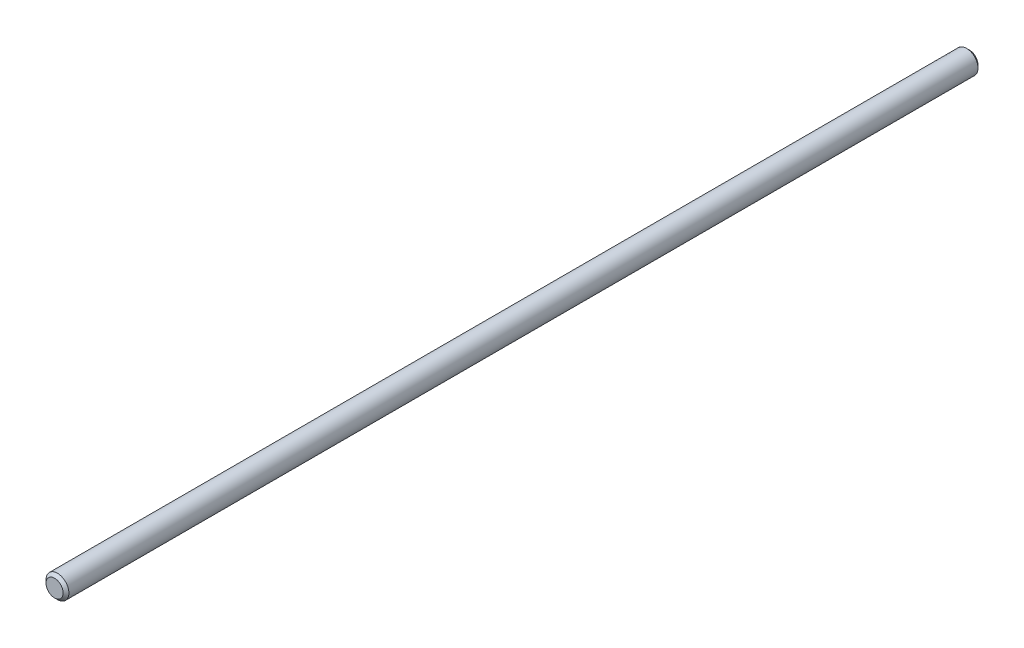
ISO-10303-21;
HEADER;
FILE_DESCRIPTION(('STEP AP214'),'2;1');
FILE_NAME('part.step','',(''),(''),'','','');
FILE_SCHEMA(('AUTOMOTIVE_DESIGN { 1 0 10303 214 1 1 1 1 }'));
ENDSEC;
DATA;
#1=APPLICATION_CONTEXT('core data for automotive mechanical design processes');
#2=APPLICATION_PROTOCOL_DEFINITION('international standard','automotive_design',2000,#1);
#3=PRODUCT_CONTEXT('',#1,'mechanical');
#4=PRODUCT('Part','Part','',(#3));
#5=PRODUCT_RELATED_PRODUCT_CATEGORY('part','',(#4));
#6=PRODUCT_DEFINITION_FORMATION('','',#4);
#7=PRODUCT_DEFINITION_CONTEXT('part definition',#1,'design');
#8=PRODUCT_DEFINITION('design','',#6,#7);
#9=PRODUCT_DEFINITION_SHAPE('','',#8);
#10=(LENGTH_UNIT() NAMED_UNIT(*) SI_UNIT(.MILLI.,.METRE.));
#11=(NAMED_UNIT(*) PLANE_ANGLE_UNIT() SI_UNIT($,.RADIAN.));
#12=(NAMED_UNIT(*) SI_UNIT($,.STERADIAN.) SOLID_ANGLE_UNIT());
#13=UNCERTAINTY_MEASURE_WITH_UNIT(LENGTH_MEASURE(1.E-05),#10,'distance_accuracy_value','');
#14=(GEOMETRIC_REPRESENTATION_CONTEXT(3) GLOBAL_UNCERTAINTY_ASSIGNED_CONTEXT((#13)) GLOBAL_UNIT_ASSIGNED_CONTEXT((#10,
#11,#12)) REPRESENTATION_CONTEXT('',''));
#15=CARTESIAN_POINT('',(0.,0.,0.));
#16=DIRECTION('',(0.,0.,1.));
#17=DIRECTION('',(1.,0.,0.));
#18=AXIS2_PLACEMENT_3D('',#15,#16,#17);
#19=CARTESIAN_POINT('',(0.,0.,80.));
#20=DIRECTION('',(0.,0.,-1.));
#21=DIRECTION('',(-1.,0.,0.));
#22=AXIS2_PLACEMENT_3D('',#19,#20,#21);
#23=CYLINDRICAL_SURFACE('',#22,2.);
#24=CARTESIAN_POINT('',(0.,0.,79.5));
#25=DIRECTION('',(0.,0.,1.));
#26=DIRECTION('',(1.,0.,0.));
#27=AXIS2_PLACEMENT_3D('',#24,#25,#26);
#28=CIRCLE('',#27,2.);
#29=CARTESIAN_POINT('',(2.,0.,79.5));
#30=VERTEX_POINT('',#29);
#31=EDGE_CURVE('E57',#30,#30,#28,.F.);
#32=ORIENTED_EDGE('',*,*,#31,.T.);
#33=EDGE_LOOP('',(#32));
#34=FACE_BOUND('',#33,.T.);
#35=CARTESIAN_POINT('',(0.,0.,-79.5));
#36=DIRECTION('',(0.,0.,1.));
#37=DIRECTION('',(1.,0.,0.));
#38=AXIS2_PLACEMENT_3D('',#35,#36,#37);
#39=CIRCLE('',#38,2.);
#40=CARTESIAN_POINT('',(2.,0.,-79.5));
#41=VERTEX_POINT('',#40);
#42=EDGE_CURVE('E61',#41,#41,#39,.T.);
#43=ORIENTED_EDGE('',*,*,#42,.T.);
#44=EDGE_LOOP('',(#43));
#45=FACE_BOUND('',#44,.T.);
#46=ADVANCED_FACE('F49',(#34,#45),#23,.T.);
#47=CARTESIAN_POINT('',(0.,0.,80.));
#48=DIRECTION('',(0.,0.,1.));
#49=DIRECTION('',(1.,0.,0.));
#50=AXIS2_PLACEMENT_3D('',#47,#48,#49);
#51=PLANE('',#50);
#52=CARTESIAN_POINT('',(0.,0.,80.));
#53=DIRECTION('',(0.,0.,1.));
#54=DIRECTION('',(1.,0.,0.));
#55=AXIS2_PLACEMENT_3D('',#52,#53,#54);
#56=CIRCLE('',#55,1.50000000000003);
#57=CARTESIAN_POINT('',(1.50000000000003,0.,80.));
#58=VERTEX_POINT('',#57);
#59=EDGE_CURVE('E65',#58,#58,#56,.T.);
#60=ORIENTED_EDGE('',*,*,#59,.T.);
#61=EDGE_LOOP('',(#60));
#62=FACE_BOUND('',#61,.T.);
#63=ADVANCED_FACE('F71',(#62),#51,.T.);
#64=CARTESIAN_POINT('',(0.,0.,-80.));
#65=DIRECTION('',(0.,0.,1.));
#66=DIRECTION('',(1.,0.,0.));
#67=AXIS2_PLACEMENT_3D('',#64,#65,#66);
#68=PLANE('',#67);
#69=CARTESIAN_POINT('',(0.,0.,-80.));
#70=DIRECTION('',(0.,0.,1.));
#71=DIRECTION('',(1.,0.,0.));
#72=AXIS2_PLACEMENT_3D('',#69,#70,#71);
#73=CIRCLE('',#72,1.49999999999996);
#74=CARTESIAN_POINT('',(1.49999999999996,0.,-80.));
#75=VERTEX_POINT('',#74);
#76=EDGE_CURVE('E10',#75,#75,#73,.F.);
#77=ORIENTED_EDGE('',*,*,#76,.T.);
#78=EDGE_LOOP('',(#77));
#79=FACE_BOUND('',#78,.T.);
#80=ADVANCED_FACE('F75',(#79),#68,.F.);
#81=CARTESIAN_POINT('',(0.,0.,80.));
#82=DIRECTION('',(0.,0.,-1.));
#83=DIRECTION('',(-1.,0.,0.));
#84=AXIS2_PLACEMENT_3D('',#81,#82,#83);
#85=CONICAL_SURFACE('',#84,1.50000000000003,0.78539816339746);
#86=ORIENTED_EDGE('',*,*,#31,.F.);
#87=EDGE_LOOP('',(#86));
#88=FACE_BOUND('',#87,.T.);
#89=ORIENTED_EDGE('',*,*,#59,.F.);
#90=EDGE_LOOP('',(#89));
#91=FACE_BOUND('',#90,.T.);
#92=ADVANCED_FACE('F73',(#88,#91),#85,.T.);
#93=CARTESIAN_POINT('',(0.,0.,-79.5));
#94=DIRECTION('',(0.,0.,1.));
#95=DIRECTION('',(1.,0.,0.));
#96=AXIS2_PLACEMENT_3D('',#93,#94,#95);
#97=CONICAL_SURFACE('',#96,2.,0.78539816339746);
#98=ORIENTED_EDGE('',*,*,#76,.F.);
#99=EDGE_LOOP('',(#98));
#100=FACE_BOUND('',#99,.T.);
#101=ORIENTED_EDGE('',*,*,#42,.F.);
#102=EDGE_LOOP('',(#101));
#103=FACE_BOUND('',#102,.T.);
#104=ADVANCED_FACE('F52',(#100,#103),#97,.T.);
#105=CLOSED_SHELL('',(#46,#63,#80,#92,#104));
#106=MANIFOLD_SOLID_BREP('B2',#105);
#107=ADVANCED_BREP_SHAPE_REPRESENTATION('',(#18,#106),#14);
#108=SHAPE_DEFINITION_REPRESENTATION(#9,#107);
ENDSEC;
END-ISO-10303-21;
